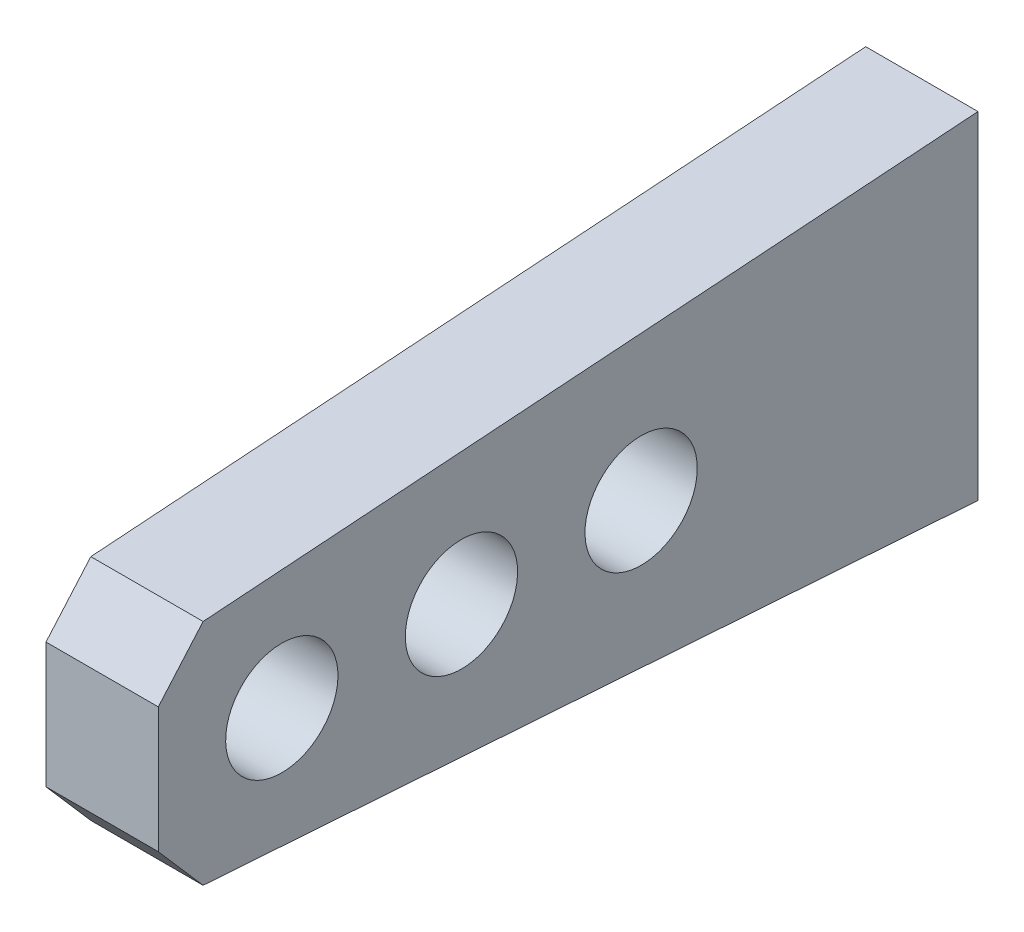
ISO-10303-21;
HEADER;
FILE_DESCRIPTION(('STEP AP214'),'2;1');
FILE_NAME('part.step','',(''),(''),'','','');
FILE_SCHEMA(('AUTOMOTIVE_DESIGN { 1 0 10303 214 1 1 1 1 }'));
ENDSEC;
DATA;
#1=APPLICATION_CONTEXT('core data for automotive mechanical design processes');
#2=APPLICATION_PROTOCOL_DEFINITION('international standard','automotive_design',2000,#1);
#3=PRODUCT_CONTEXT('',#1,'mechanical');
#4=PRODUCT('Part','Part','',(#3));
#5=PRODUCT_RELATED_PRODUCT_CATEGORY('part','',(#4));
#6=PRODUCT_DEFINITION_FORMATION('','',#4);
#7=PRODUCT_DEFINITION_CONTEXT('part definition',#1,'design');
#8=PRODUCT_DEFINITION('design','',#6,#7);
#9=PRODUCT_DEFINITION_SHAPE('','',#8);
#10=(LENGTH_UNIT() NAMED_UNIT(*) SI_UNIT(.MILLI.,.METRE.));
#11=(NAMED_UNIT(*) PLANE_ANGLE_UNIT() SI_UNIT($,.RADIAN.));
#12=(NAMED_UNIT(*) SI_UNIT($,.STERADIAN.) SOLID_ANGLE_UNIT());
#13=UNCERTAINTY_MEASURE_WITH_UNIT(LENGTH_MEASURE(1.E-05),#10,'distance_accuracy_value','');
#14=(GEOMETRIC_REPRESENTATION_CONTEXT(3) GLOBAL_UNCERTAINTY_ASSIGNED_CONTEXT((#13)) GLOBAL_UNIT_ASSIGNED_CONTEXT((#10,
#11,#12)) REPRESENTATION_CONTEXT('',''));
#15=CARTESIAN_POINT('',(0.,0.,0.));
#16=DIRECTION('',(0.,0.,1.));
#17=DIRECTION('',(1.,0.,0.));
#18=AXIS2_PLACEMENT_3D('',#15,#16,#17);
#19=CARTESIAN_POINT('',(0.5,1.5,7.3));
#20=DIRECTION('',(-1.,0.,0.));
#21=DIRECTION('',(0.,-1.,0.));
#22=AXIS2_PLACEMENT_3D('',#19,#20,#21);
#23=PLANE('',#22);
#24=CARTESIAN_POINT('',(0.5,0.,6.2));
#25=DIRECTION('',(1.,0.,0.));
#26=DIRECTION('',(0.,1.,0.));
#27=AXIS2_PLACEMENT_3D('',#24,#25,#26);
#28=CIRCLE('',#27,0.500000000000001);
#29=CARTESIAN_POINT('',(0.5,0.500000000000001,6.2));
#30=VERTEX_POINT('',#29);
#31=EDGE_CURVE('E106',#30,#30,#28,.T.);
#32=ORIENTED_EDGE('',*,*,#31,.F.);
#33=EDGE_LOOP('',(#32));
#34=FACE_BOUND('',#33,.T.);
#35=CARTESIAN_POINT('',(0.5,0.,4.6));
#36=DIRECTION('',(1.,0.,0.));
#37=DIRECTION('',(0.,1.,0.));
#38=AXIS2_PLACEMENT_3D('',#35,#36,#37);
#39=CIRCLE('',#38,0.500000000000001);
#40=CARTESIAN_POINT('',(0.5,0.500000000000001,4.6));
#41=VERTEX_POINT('',#40);
#42=EDGE_CURVE('E187',#41,#41,#39,.T.);
#43=ORIENTED_EDGE('',*,*,#42,.F.);
#44=EDGE_LOOP('',(#43));
#45=FACE_BOUND('',#44,.T.);
#46=CARTESIAN_POINT('',(0.5,0.,3.));
#47=DIRECTION('',(1.,0.,0.));
#48=DIRECTION('',(0.,1.,0.));
#49=AXIS2_PLACEMENT_3D('',#46,#47,#48);
#50=CIRCLE('',#49,0.500000000000001);
#51=CARTESIAN_POINT('',(0.5,0.500000000000001,3.));
#52=VERTEX_POINT('',#51);
#53=EDGE_CURVE('E193',#52,#52,#50,.T.);
#54=ORIENTED_EDGE('',*,*,#53,.F.);
#55=EDGE_LOOP('',(#54));
#56=FACE_BOUND('',#55,.T.);
#57=DIRECTION('',(0.,-0.0697564737441255,0.997564050259824));
#58=VECTOR('',#57,1.);
#59=CARTESIAN_POINT('',(0.5,1.5,0.));
#60=LINE('',#59,#58);
#61=CARTESIAN_POINT('',(0.5,1.01743686231002,6.90097437989607));
#62=VERTEX_POINT('',#61);
#63=CARTESIAN_POINT('',(0.5,1.5,0.));
#64=VERTEX_POINT('',#63);
#65=EDGE_CURVE('E83',#62,#64,#60,.F.);
#66=ORIENTED_EDGE('',*,*,#65,.F.);
#67=DIRECTION('',(0.,0.754709580222771,-0.656059028990509));
#68=VECTOR('',#67,1.);
#69=CARTESIAN_POINT('',(0.5,0.558410395270688,7.3));
#70=LINE('',#69,#68);
#71=CARTESIAN_POINT('',(0.5,0.558410395270689,7.3));
#72=VERTEX_POINT('',#71);
#73=EDGE_CURVE('E40',#62,#72,#70,.F.);
#74=ORIENTED_EDGE('',*,*,#73,.T.);
#75=DIRECTION('',(0.,1.,0.));
#76=VECTOR('',#75,1.);
#77=CARTESIAN_POINT('',(0.5,1.5,7.3));
#78=LINE('',#77,#76);
#79=CARTESIAN_POINT('',(0.5,-0.558410395270687,7.3));
#80=VERTEX_POINT('',#79);
#81=EDGE_CURVE('E114',#80,#72,#78,.T.);
#82=ORIENTED_EDGE('',*,*,#81,.F.);
#83=DIRECTION('',(0.,0.754709580222771,0.656059028990509));
#84=VECTOR('',#83,1.);
#85=CARTESIAN_POINT('',(0.5,-0.558410395270688,7.3));
#86=LINE('',#85,#84);
#87=CARTESIAN_POINT('',(0.5,-1.01743686231002,6.90097437989607));
#88=VERTEX_POINT('',#87);
#89=EDGE_CURVE('E47',#80,#88,#86,.F.);
#90=ORIENTED_EDGE('',*,*,#89,.T.);
#91=DIRECTION('',(0.,0.0697564737441255,0.997564050259824));
#92=VECTOR('',#91,1.);
#93=CARTESIAN_POINT('',(0.5,-0.977420284608115,7.47323810234683));
#94=LINE('',#93,#92);
#95=CARTESIAN_POINT('',(0.5,-1.5,0.));
#96=VERTEX_POINT('',#95);
#97=EDGE_CURVE('E101',#88,#96,#94,.F.);
#98=ORIENTED_EDGE('',*,*,#97,.T.);
#99=DIRECTION('',(0.,1.,0.));
#100=VECTOR('',#99,1.);
#101=CARTESIAN_POINT('',(0.5,1.5,0.));
#102=LINE('',#101,#100);
#103=EDGE_CURVE('E97',#96,#64,#102,.T.);
#104=ORIENTED_EDGE('',*,*,#103,.T.);
#105=EDGE_LOOP('',(#66,#74,#82,#90,#98,#104));
#106=FACE_BOUND('',#105,.T.);
#107=ADVANCED_FACE('F32',(#34,#45,#56,#106),#23,.F.);
#108=CARTESIAN_POINT('',(-0.5,1.5,0.));
#109=DIRECTION('',(0.,0.997564050259824,0.0697564737441255));
#110=DIRECTION('',(0.,-0.0697564737441255,0.997564050259824));
#111=AXIS2_PLACEMENT_3D('',#108,#109,#110);
#112=PLANE('',#111);
#113=DIRECTION('',(0.,-0.0697564737441255,0.997564050259824));
#114=VECTOR('',#113,1.);
#115=CARTESIAN_POINT('',(-0.5,0.992018181495761,7.26447845090673));
#116=LINE('',#115,#114);
#117=CARTESIAN_POINT('',(-0.5,1.01743686231002,6.90097437989607));
#118=VERTEX_POINT('',#117);
#119=CARTESIAN_POINT('',(-0.5,1.5,0.));
#120=VERTEX_POINT('',#119);
#121=EDGE_CURVE('E91',#118,#120,#116,.F.);
#122=ORIENTED_EDGE('',*,*,#121,.F.);
#123=DIRECTION('',(-1.,0.,0.));
#124=VECTOR('',#123,1.);
#125=CARTESIAN_POINT('',(0.5,1.01743686231002,6.90097437989607));
#126=LINE('',#125,#124);
#127=EDGE_CURVE('E55',#118,#62,#126,.F.);
#128=ORIENTED_EDGE('',*,*,#127,.T.);
#129=ORIENTED_EDGE('',*,*,#65,.T.);
#130=DIRECTION('',(-1.,0.,0.));
#131=VECTOR('',#130,1.);
#132=CARTESIAN_POINT('',(-0.5,1.5,0.));
#133=LINE('',#132,#131);
#134=EDGE_CURVE('E86',#64,#120,#133,.T.);
#135=ORIENTED_EDGE('',*,*,#134,.T.);
#136=EDGE_LOOP('',(#122,#128,#129,#135));
#137=FACE_BOUND('',#136,.T.);
#138=ADVANCED_FACE('F85',(#137),#112,.T.);
#139=CARTESIAN_POINT('',(-0.5,1.5,7.3));
#140=DIRECTION('',(1.,0.,0.));
#141=DIRECTION('',(0.,1.,0.));
#142=AXIS2_PLACEMENT_3D('',#139,#140,#141);
#143=PLANE('',#142);
#144=CARTESIAN_POINT('',(-0.5,0.,6.2));
#145=DIRECTION('',(1.,0.,0.));
#146=DIRECTION('',(0.,1.,0.));
#147=AXIS2_PLACEMENT_3D('',#144,#145,#146);
#148=CIRCLE('',#147,0.500000000000001);
#149=CARTESIAN_POINT('',(-0.5,0.500000000000001,6.2));
#150=VERTEX_POINT('',#149);
#151=EDGE_CURVE('E103',#150,#150,#148,.F.);
#152=ORIENTED_EDGE('',*,*,#151,.F.);
#153=EDGE_LOOP('',(#152));
#154=FACE_BOUND('',#153,.T.);
#155=CARTESIAN_POINT('',(-0.5,0.,4.6));
#156=DIRECTION('',(1.,0.,0.));
#157=DIRECTION('',(0.,1.,0.));
#158=AXIS2_PLACEMENT_3D('',#155,#156,#157);
#159=CIRCLE('',#158,0.500000000000001);
#160=CARTESIAN_POINT('',(-0.5,0.500000000000001,4.6));
#161=VERTEX_POINT('',#160);
#162=EDGE_CURVE('E184',#161,#161,#159,.F.);
#163=ORIENTED_EDGE('',*,*,#162,.F.);
#164=EDGE_LOOP('',(#163));
#165=FACE_BOUND('',#164,.T.);
#166=CARTESIAN_POINT('',(-0.5,0.,3.));
#167=DIRECTION('',(1.,0.,0.));
#168=DIRECTION('',(0.,1.,0.));
#169=AXIS2_PLACEMENT_3D('',#166,#167,#168);
#170=CIRCLE('',#169,0.500000000000001);
#171=CARTESIAN_POINT('',(-0.5,0.500000000000001,3.));
#172=VERTEX_POINT('',#171);
#173=EDGE_CURVE('E191',#172,#172,#170,.F.);
#174=ORIENTED_EDGE('',*,*,#173,.F.);
#175=EDGE_LOOP('',(#174));
#176=FACE_BOUND('',#175,.T.);
#177=DIRECTION('',(0.,-1.,0.));
#178=VECTOR('',#177,1.);
#179=CARTESIAN_POINT('',(-0.5,1.5,7.3));
#180=LINE('',#179,#178);
#181=CARTESIAN_POINT('',(-0.5,0.558410395270689,7.3));
#182=VERTEX_POINT('',#181);
#183=CARTESIAN_POINT('',(-0.5,-0.558410395270687,7.3));
#184=VERTEX_POINT('',#183);
#185=EDGE_CURVE('E109',#182,#184,#180,.T.);
#186=ORIENTED_EDGE('',*,*,#185,.F.);
#187=DIRECTION('',(0.,-0.754709580222771,0.656059028990509));
#188=VECTOR('',#187,1.);
#189=CARTESIAN_POINT('',(-0.5,0.558410395270688,7.3));
#190=LINE('',#189,#188);
#191=EDGE_CURVE('E127',#182,#118,#190,.F.);
#192=ORIENTED_EDGE('',*,*,#191,.T.);
#193=ORIENTED_EDGE('',*,*,#121,.T.);
#194=DIRECTION('',(0.,-1.,0.));
#195=VECTOR('',#194,1.);
#196=CARTESIAN_POINT('',(-0.5,1.5,0.));
#197=LINE('',#196,#195);
#198=CARTESIAN_POINT('',(-0.5,-1.5,0.));
#199=VERTEX_POINT('',#198);
#200=EDGE_CURVE('E99',#120,#199,#197,.T.);
#201=ORIENTED_EDGE('',*,*,#200,.T.);
#202=DIRECTION('',(0.,0.0697564737441255,0.997564050259824));
#203=VECTOR('',#202,1.);
#204=CARTESIAN_POINT('',(-0.5,-1.5,0.));
#205=LINE('',#204,#203);
#206=CARTESIAN_POINT('',(-0.5,-1.01743686231002,6.90097437989607));
#207=VERTEX_POINT('',#206);
#208=EDGE_CURVE('E117',#207,#199,#205,.F.);
#209=ORIENTED_EDGE('',*,*,#208,.F.);
#210=DIRECTION('',(0.,-0.754709580222771,-0.656059028990509));
#211=VECTOR('',#210,1.);
#212=CARTESIAN_POINT('',(-0.5,-0.558410395270688,7.3));
#213=LINE('',#212,#211);
#214=EDGE_CURVE('E125',#207,#184,#213,.F.);
#215=ORIENTED_EDGE('',*,*,#214,.T.);
#216=EDGE_LOOP('',(#186,#192,#193,#201,#209,#215));
#217=FACE_BOUND('',#216,.T.);
#218=ADVANCED_FACE('F140',(#154,#165,#176,#217),#143,.F.);
#219=CARTESIAN_POINT('',(-0.5,-1.5,0.));
#220=DIRECTION('',(0.,-0.997564050259824,0.0697564737441255));
#221=DIRECTION('',(0.,-0.0697564737441255,-0.997564050259824));
#222=AXIS2_PLACEMENT_3D('',#219,#220,#221);
#223=PLANE('',#222);
#224=ORIENTED_EDGE('',*,*,#97,.F.);
#225=DIRECTION('',(1.,0.,0.));
#226=VECTOR('',#225,1.);
#227=CARTESIAN_POINT('',(-0.5,-1.01743686231002,6.90097437989607));
#228=LINE('',#227,#226);
#229=EDGE_CURVE('E11',#88,#207,#228,.F.);
#230=ORIENTED_EDGE('',*,*,#229,.T.);
#231=ORIENTED_EDGE('',*,*,#208,.T.);
#232=DIRECTION('',(1.,0.,0.));
#233=VECTOR('',#232,1.);
#234=CARTESIAN_POINT('',(-0.5,-1.5,0.));
#235=LINE('',#234,#233);
#236=EDGE_CURVE('E113',#199,#96,#235,.T.);
#237=ORIENTED_EDGE('',*,*,#236,.T.);
#238=EDGE_LOOP('',(#224,#230,#231,#237));
#239=FACE_BOUND('',#238,.T.);
#240=ADVANCED_FACE('F146',(#239),#223,.T.);
#241=CARTESIAN_POINT('',(0.,0.,7.3));
#242=DIRECTION('',(0.,0.,1.));
#243=DIRECTION('',(1.,0.,0.));
#244=AXIS2_PLACEMENT_3D('',#241,#242,#243);
#245=PLANE('',#244);
#246=ORIENTED_EDGE('',*,*,#81,.T.);
#247=DIRECTION('',(-1.,0.,0.));
#248=VECTOR('',#247,1.);
#249=CARTESIAN_POINT('',(-0.5,0.558410395270688,7.3));
#250=LINE('',#249,#248);
#251=EDGE_CURVE('E122',#72,#182,#250,.T.);
#252=ORIENTED_EDGE('',*,*,#251,.T.);
#253=ORIENTED_EDGE('',*,*,#185,.T.);
#254=DIRECTION('',(1.,0.,0.));
#255=VECTOR('',#254,1.);
#256=CARTESIAN_POINT('',(0.5,-0.558410395270688,7.3));
#257=LINE('',#256,#255);
#258=EDGE_CURVE('E90',#184,#80,#257,.T.);
#259=ORIENTED_EDGE('',*,*,#258,.T.);
#260=EDGE_LOOP('',(#246,#252,#253,#259));
#261=FACE_BOUND('',#260,.T.);
#262=ADVANCED_FACE('F134',(#261),#245,.T.);
#263=CARTESIAN_POINT('',(0.,0.,0.));
#264=DIRECTION('',(0.,0.,1.));
#265=DIRECTION('',(1.,0.,0.));
#266=AXIS2_PLACEMENT_3D('',#263,#264,#265);
#267=PLANE('',#266);
#268=ORIENTED_EDGE('',*,*,#103,.F.);
#269=ORIENTED_EDGE('',*,*,#236,.F.);
#270=ORIENTED_EDGE('',*,*,#200,.F.);
#271=ORIENTED_EDGE('',*,*,#134,.F.);
#272=EDGE_LOOP('',(#268,#269,#270,#271));
#273=FACE_BOUND('',#272,.T.);
#274=ADVANCED_FACE('F95',(#273),#267,.F.);
#275=CARTESIAN_POINT('',(0.,0.558410395270688,7.3));
#276=DIRECTION('',(0.,-0.656059028990509,-0.754709580222771));
#277=DIRECTION('',(-1.,0.,0.));
#278=AXIS2_PLACEMENT_3D('',#275,#276,#277);
#279=PLANE('',#278);
#280=ORIENTED_EDGE('',*,*,#73,.F.);
#281=ORIENTED_EDGE('',*,*,#127,.F.);
#282=ORIENTED_EDGE('',*,*,#191,.F.);
#283=ORIENTED_EDGE('',*,*,#251,.F.);
#284=EDGE_LOOP('',(#280,#281,#282,#283));
#285=FACE_BOUND('',#284,.T.);
#286=ADVANCED_FACE('F138',(#285),#279,.F.);
#287=CARTESIAN_POINT('',(0.,-0.558410395270688,7.3));
#288=DIRECTION('',(0.,0.656059028990508,-0.754709580222771));
#289=DIRECTION('',(1.,0.,0.));
#290=AXIS2_PLACEMENT_3D('',#287,#288,#289);
#291=PLANE('',#290);
#292=ORIENTED_EDGE('',*,*,#214,.F.);
#293=ORIENTED_EDGE('',*,*,#229,.F.);
#294=ORIENTED_EDGE('',*,*,#89,.F.);
#295=ORIENTED_EDGE('',*,*,#258,.F.);
#296=EDGE_LOOP('',(#292,#293,#294,#295));
#297=FACE_BOUND('',#296,.T.);
#298=ADVANCED_FACE('F34',(#297),#291,.F.);
#299=CARTESIAN_POINT('',(-1.9142135623731,0.,3.));
#300=DIRECTION('',(1.,0.,0.));
#301=DIRECTION('',(0.,1.,0.));
#302=AXIS2_PLACEMENT_3D('',#299,#300,#301);
#303=CYLINDRICAL_SURFACE('',#302,0.500000000000001);
#304=ORIENTED_EDGE('',*,*,#173,.T.);
#305=EDGE_LOOP('',(#304));
#306=FACE_BOUND('',#305,.T.);
#307=ORIENTED_EDGE('',*,*,#53,.T.);
#308=EDGE_LOOP('',(#307));
#309=FACE_BOUND('',#308,.T.);
#310=ADVANCED_FACE('F168',(#306,#309),#303,.F.);
#311=CARTESIAN_POINT('',(-1.9142135623731,0.,4.6));
#312=DIRECTION('',(1.,0.,0.));
#313=DIRECTION('',(0.,1.,0.));
#314=AXIS2_PLACEMENT_3D('',#311,#312,#313);
#315=CYLINDRICAL_SURFACE('',#314,0.500000000000001);
#316=ORIENTED_EDGE('',*,*,#162,.T.);
#317=EDGE_LOOP('',(#316));
#318=FACE_BOUND('',#317,.T.);
#319=ORIENTED_EDGE('',*,*,#42,.T.);
#320=EDGE_LOOP('',(#319));
#321=FACE_BOUND('',#320,.T.);
#322=ADVANCED_FACE('F171',(#318,#321),#315,.F.);
#323=CARTESIAN_POINT('',(-1.9142135623731,0.,6.2));
#324=DIRECTION('',(1.,0.,0.));
#325=DIRECTION('',(0.,1.,0.));
#326=AXIS2_PLACEMENT_3D('',#323,#324,#325);
#327=CYLINDRICAL_SURFACE('',#326,0.500000000000001);
#328=ORIENTED_EDGE('',*,*,#151,.T.);
#329=EDGE_LOOP('',(#328));
#330=FACE_BOUND('',#329,.T.);
#331=ORIENTED_EDGE('',*,*,#31,.T.);
#332=EDGE_LOOP('',(#331));
#333=FACE_BOUND('',#332,.T.);
#334=ADVANCED_FACE('F175',(#330,#333),#327,.F.);
#335=CLOSED_SHELL('',(#107,#138,#218,#240,#262,#274,#286,#298,#310,#322,#334));
#336=MANIFOLD_SOLID_BREP('B2',#335);
#337=ADVANCED_BREP_SHAPE_REPRESENTATION('',(#18,#336),#14);
#338=SHAPE_DEFINITION_REPRESENTATION(#9,#337);
ENDSEC;
END-ISO-10303-21;
